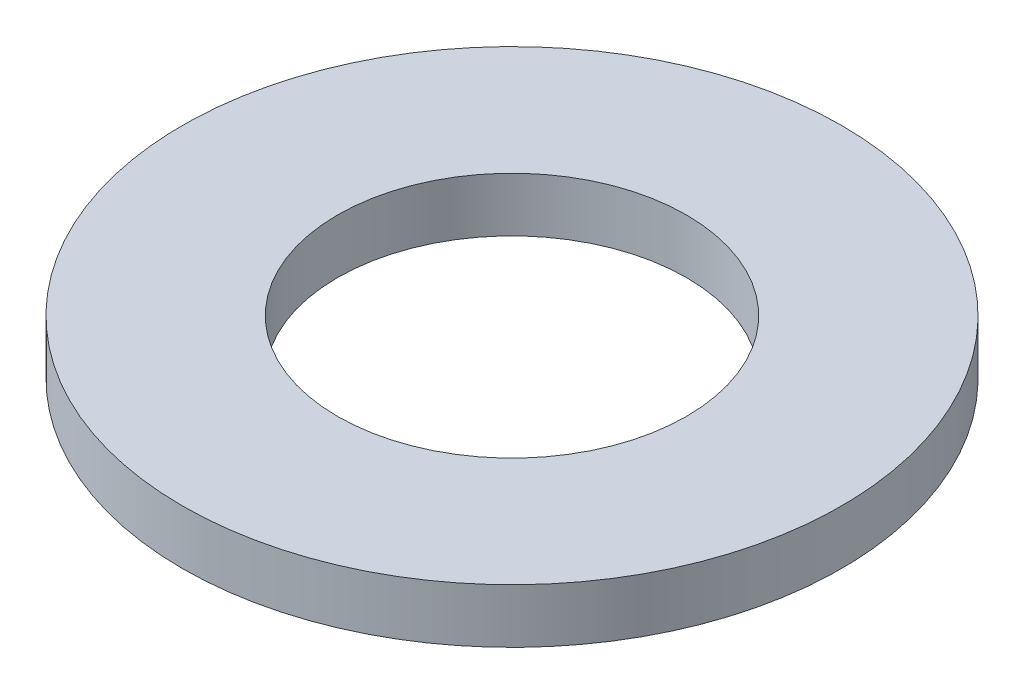
ISO-10303-21;
HEADER;
FILE_DESCRIPTION(('STEP AP214'),'2;1');
FILE_NAME('part.step','',(''),(''),'','','');
FILE_SCHEMA(('AUTOMOTIVE_DESIGN { 1 0 10303 214 1 1 1 1 }'));
ENDSEC;
DATA;
#1=APPLICATION_CONTEXT('core data for automotive mechanical design processes');
#2=APPLICATION_PROTOCOL_DEFINITION('international standard','automotive_design',2000,#1);
#3=PRODUCT_CONTEXT('',#1,'mechanical');
#4=PRODUCT('Part','Part','',(#3));
#5=PRODUCT_RELATED_PRODUCT_CATEGORY('part','',(#4));
#6=PRODUCT_DEFINITION_FORMATION('','',#4);
#7=PRODUCT_DEFINITION_CONTEXT('part definition',#1,'design');
#8=PRODUCT_DEFINITION('design','',#6,#7);
#9=PRODUCT_DEFINITION_SHAPE('','',#8);
#10=(LENGTH_UNIT() NAMED_UNIT(*) SI_UNIT(.MILLI.,.METRE.));
#11=(NAMED_UNIT(*) PLANE_ANGLE_UNIT() SI_UNIT($,.RADIAN.));
#12=(NAMED_UNIT(*) SI_UNIT($,.STERADIAN.) SOLID_ANGLE_UNIT());
#13=UNCERTAINTY_MEASURE_WITH_UNIT(LENGTH_MEASURE(1.E-05),#10,'distance_accuracy_value','');
#14=(GEOMETRIC_REPRESENTATION_CONTEXT(3) GLOBAL_UNCERTAINTY_ASSIGNED_CONTEXT((#13)) GLOBAL_UNIT_ASSIGNED_CONTEXT((#10,
#11,#12)) REPRESENTATION_CONTEXT('',''));
#15=CARTESIAN_POINT('',(0.,0.,0.));
#16=DIRECTION('',(0.,0.,1.));
#17=DIRECTION('',(1.,0.,0.));
#18=AXIS2_PLACEMENT_3D('',#15,#16,#17);
#19=CARTESIAN_POINT('',(0.,14.,0.));
#20=DIRECTION('',(0.,-1.,0.));
#21=DIRECTION('',(0.,0.,-1.));
#22=AXIS2_PLACEMENT_3D('',#19,#20,#21);
#23=CYLINDRICAL_SURFACE('',#22,85.);
#24=CARTESIAN_POINT('',(0.,14.,0.));
#25=DIRECTION('',(0.,1.,0.));
#26=DIRECTION('',(0.,0.,1.));
#27=AXIS2_PLACEMENT_3D('',#24,#25,#26);
#28=CIRCLE('',#27,85.);
#29=CARTESIAN_POINT('',(0.,14.,85.));
#30=VERTEX_POINT('',#29);
#31=EDGE_CURVE('E10',#30,#30,#28,.T.);
#32=ORIENTED_EDGE('',*,*,#31,.F.);
#33=EDGE_LOOP('',(#32));
#34=FACE_BOUND('',#33,.T.);
#35=CARTESIAN_POINT('',(0.,0.,0.));
#36=DIRECTION('',(0.,1.,0.));
#37=DIRECTION('',(0.,0.,1.));
#38=AXIS2_PLACEMENT_3D('',#35,#36,#37);
#39=CIRCLE('',#38,85.);
#40=CARTESIAN_POINT('',(0.,0.,85.));
#41=VERTEX_POINT('',#40);
#42=EDGE_CURVE('E37',#41,#41,#39,.T.);
#43=ORIENTED_EDGE('',*,*,#42,.T.);
#44=EDGE_LOOP('',(#43));
#45=FACE_BOUND('',#44,.T.);
#46=ADVANCED_FACE('F40',(#34,#45),#23,.T.);
#47=CARTESIAN_POINT('',(0.,14.,0.));
#48=DIRECTION('',(0.,1.,0.));
#49=DIRECTION('',(0.,0.,1.));
#50=AXIS2_PLACEMENT_3D('',#47,#48,#49);
#51=PLANE('',#50);
#52=CARTESIAN_POINT('',(0.,14.,0.));
#53=DIRECTION('',(0.,1.,0.));
#54=DIRECTION('',(0.,0.,1.));
#55=AXIS2_PLACEMENT_3D('',#52,#53,#54);
#56=CIRCLE('',#55,45.);
#57=CARTESIAN_POINT('',(0.,14.,45.));
#58=VERTEX_POINT('',#57);
#59=EDGE_CURVE('E50',#58,#58,#56,.T.);
#60=ORIENTED_EDGE('',*,*,#59,.F.);
#61=EDGE_LOOP('',(#60));
#62=FACE_BOUND('',#61,.T.);
#63=ORIENTED_EDGE('',*,*,#31,.T.);
#64=EDGE_LOOP('',(#63));
#65=FACE_BOUND('',#64,.T.);
#66=ADVANCED_FACE('F59',(#62,#65),#51,.T.);
#67=CARTESIAN_POINT('',(0.,0.,0.));
#68=DIRECTION('',(0.,1.,0.));
#69=DIRECTION('',(0.,0.,1.));
#70=AXIS2_PLACEMENT_3D('',#67,#68,#69);
#71=PLANE('',#70);
#72=CARTESIAN_POINT('',(0.,0.,0.));
#73=DIRECTION('',(0.,1.,0.));
#74=DIRECTION('',(0.,0.,1.));
#75=AXIS2_PLACEMENT_3D('',#72,#73,#74);
#76=CIRCLE('',#75,45.);
#77=CARTESIAN_POINT('',(0.,0.,45.));
#78=VERTEX_POINT('',#77);
#79=EDGE_CURVE('E47',#78,#78,#76,.T.);
#80=ORIENTED_EDGE('',*,*,#79,.T.);
#81=EDGE_LOOP('',(#80));
#82=FACE_BOUND('',#81,.T.);
#83=ORIENTED_EDGE('',*,*,#42,.F.);
#84=EDGE_LOOP('',(#83));
#85=FACE_BOUND('',#84,.T.);
#86=ADVANCED_FACE('F58',(#82,#85),#71,.F.);
#87=CARTESIAN_POINT('',(0.,14.,0.));
#88=DIRECTION('',(0.,-1.,0.));
#89=DIRECTION('',(0.,0.,-1.));
#90=AXIS2_PLACEMENT_3D('',#87,#88,#89);
#91=CYLINDRICAL_SURFACE('',#90,45.);
#92=ORIENTED_EDGE('',*,*,#59,.T.);
#93=EDGE_LOOP('',(#92));
#94=FACE_BOUND('',#93,.T.);
#95=ORIENTED_EDGE('',*,*,#79,.F.);
#96=EDGE_LOOP('',(#95));
#97=FACE_BOUND('',#96,.T.);
#98=ADVANCED_FACE('F54',(#94,#97),#91,.F.);
#99=CLOSED_SHELL('',(#46,#66,#86,#98));
#100=MANIFOLD_SOLID_BREP('B2',#99);
#101=ADVANCED_BREP_SHAPE_REPRESENTATION('',(#18,#100),#14);
#102=SHAPE_DEFINITION_REPRESENTATION(#9,#101);
ENDSEC;
END-ISO-10303-21;
